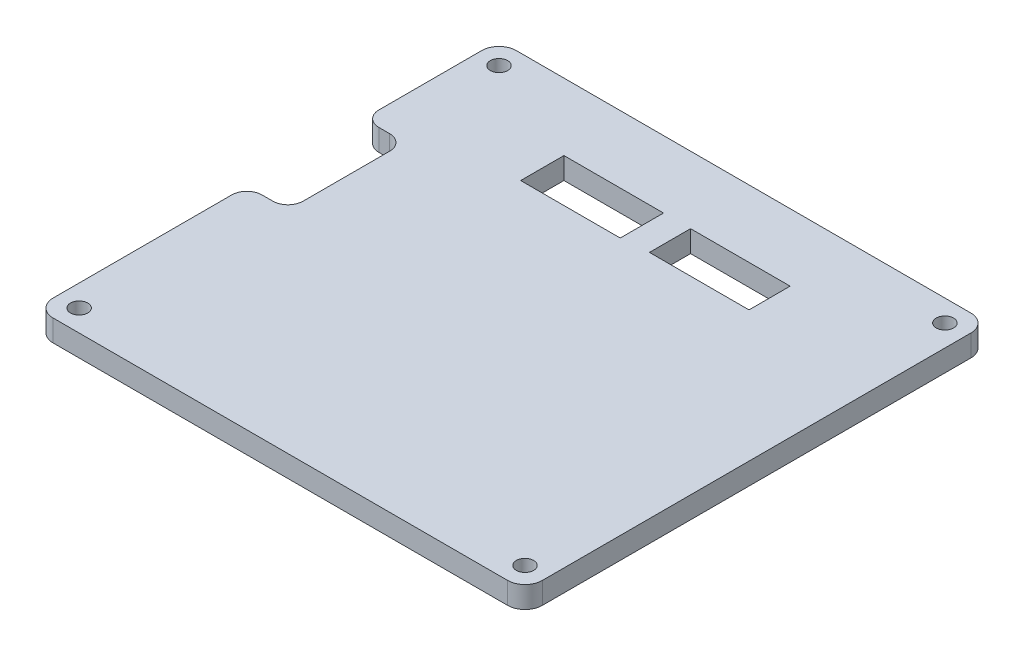
ISO-10303-21;
HEADER;
FILE_DESCRIPTION(('STEP AP214'),'2;1');
FILE_NAME('part.step','',(''),(''),'','','');
FILE_SCHEMA(('AUTOMOTIVE_DESIGN { 1 0 10303 214 1 1 1 1 }'));
ENDSEC;
DATA;
#1=APPLICATION_CONTEXT('core data for automotive mechanical design processes');
#2=APPLICATION_PROTOCOL_DEFINITION('international standard','automotive_design',2000,#1);
#3=PRODUCT_CONTEXT('',#1,'mechanical');
#4=PRODUCT('Part','Part','',(#3));
#5=PRODUCT_RELATED_PRODUCT_CATEGORY('part','',(#4));
#6=PRODUCT_DEFINITION_FORMATION('','',#4);
#7=PRODUCT_DEFINITION_CONTEXT('part definition',#1,'design');
#8=PRODUCT_DEFINITION('design','',#6,#7);
#9=PRODUCT_DEFINITION_SHAPE('','',#8);
#10=(LENGTH_UNIT() NAMED_UNIT(*) SI_UNIT(.MILLI.,.METRE.));
#11=(NAMED_UNIT(*) PLANE_ANGLE_UNIT() SI_UNIT($,.RADIAN.));
#12=(NAMED_UNIT(*) SI_UNIT($,.STERADIAN.) SOLID_ANGLE_UNIT());
#13=UNCERTAINTY_MEASURE_WITH_UNIT(LENGTH_MEASURE(1.E-05),#10,'distance_accuracy_value','');
#14=(GEOMETRIC_REPRESENTATION_CONTEXT(3) GLOBAL_UNCERTAINTY_ASSIGNED_CONTEXT((#13)) GLOBAL_UNIT_ASSIGNED_CONTEXT((#10,
#11,#12)) REPRESENTATION_CONTEXT('',''));
#15=CARTESIAN_POINT('',(0.,0.,0.));
#16=DIRECTION('',(0.,0.,1.));
#17=DIRECTION('',(1.,0.,0.));
#18=AXIS2_PLACEMENT_3D('',#15,#16,#17);
#19=CARTESIAN_POINT('',(-56.5,5.,53.5));
#20=DIRECTION('',(1.,0.,0.));
#21=DIRECTION('',(0.,0.,-1.));
#22=AXIS2_PLACEMENT_3D('',#19,#20,#21);
#23=PLANE('',#22);
#24=DIRECTION('',(0.,0.,1.));
#25=VECTOR('',#24,1.);
#26=CARTESIAN_POINT('',(-56.5,5.,53.5));
#27=LINE('',#26,#25);
#28=CARTESIAN_POINT('',(-56.5,5.,8.25));
#29=VERTEX_POINT('',#28);
#30=CARTESIAN_POINT('',(-56.5,5.,49.5));
#31=VERTEX_POINT('',#30);
#32=EDGE_CURVE('E317',#29,#31,#27,.T.);
#33=ORIENTED_EDGE('',*,*,#32,.F.);
#34=DIRECTION('',(0.,-1.,0.));
#35=VECTOR('',#34,1.);
#36=CARTESIAN_POINT('',(-56.5,5.,8.25));
#37=LINE('',#36,#35);
#38=CARTESIAN_POINT('',(-56.5,0.,8.25));
#39=VERTEX_POINT('',#38);
#40=EDGE_CURVE('E395',#29,#39,#37,.T.);
#41=ORIENTED_EDGE('',*,*,#40,.T.);
#42=DIRECTION('',(0.,0.,1.));
#43=VECTOR('',#42,1.);
#44=CARTESIAN_POINT('',(-56.5,0.,53.5));
#45=LINE('',#44,#43);
#46=CARTESIAN_POINT('',(-56.5,0.,49.5));
#47=VERTEX_POINT('',#46);
#48=EDGE_CURVE('E329',#39,#47,#45,.T.);
#49=ORIENTED_EDGE('',*,*,#48,.T.);
#50=DIRECTION('',(0.,-1.,0.));
#51=VECTOR('',#50,1.);
#52=CARTESIAN_POINT('',(-56.5,5.,49.5));
#53=LINE('',#52,#51);
#54=EDGE_CURVE('E368',#47,#31,#53,.F.);
#55=ORIENTED_EDGE('',*,*,#54,.T.);
#56=EDGE_LOOP('',(#33,#41,#49,#55));
#57=FACE_BOUND('',#56,.T.);
#58=ADVANCED_FACE('F33',(#57),#23,.F.);
#59=CARTESIAN_POINT('',(0.,0.,0.));
#60=DIRECTION('',(0.,-1.,0.));
#61=DIRECTION('',(0.,0.,-1.));
#62=AXIS2_PLACEMENT_3D('',#59,#60,#61);
#63=PLANE('',#62);
#64=ORIENTED_EDGE('',*,*,#48,.F.);
#65=CARTESIAN_POINT('',(-53.,0.,8.25));
#66=DIRECTION('',(0.,-1.,0.));
#67=DIRECTION('',(0.,0.,-1.));
#68=AXIS2_PLACEMENT_3D('',#65,#66,#67);
#69=CIRCLE('',#68,3.5);
#70=CARTESIAN_POINT('',(-53.,0.,4.75));
#71=VERTEX_POINT('',#70);
#72=EDGE_CURVE('E399',#39,#71,#69,.T.);
#73=ORIENTED_EDGE('',*,*,#72,.T.);
#74=DIRECTION('',(-1.,0.,0.));
#75=VECTOR('',#74,1.);
#76=CARTESIAN_POINT('',(-47.,0.,4.75));
#77=LINE('',#76,#75);
#78=CARTESIAN_POINT('',(-50.5,0.,4.75));
#79=VERTEX_POINT('',#78);
#80=EDGE_CURVE('E443',#79,#71,#77,.T.);
#81=ORIENTED_EDGE('',*,*,#80,.F.);
#82=CARTESIAN_POINT('',(-50.5,0.,1.25));
#83=DIRECTION('',(0.,-1.,0.));
#84=DIRECTION('',(0.,0.,-1.));
#85=AXIS2_PLACEMENT_3D('',#82,#83,#84);
#86=CIRCLE('',#85,3.5);
#87=CARTESIAN_POINT('',(-47.,0.,1.25));
#88=VERTEX_POINT('',#87);
#89=EDGE_CURVE('E406',#79,#88,#86,.F.);
#90=ORIENTED_EDGE('',*,*,#89,.T.);
#91=DIRECTION('',(0.,0.,1.));
#92=VECTOR('',#91,1.);
#93=CARTESIAN_POINT('',(-47.,0.,4.75));
#94=LINE('',#93,#92);
#95=CARTESIAN_POINT('',(-47.,0.,-18.75));
#96=VERTEX_POINT('',#95);
#97=EDGE_CURVE('E416',#96,#88,#94,.T.);
#98=ORIENTED_EDGE('',*,*,#97,.F.);
#99=CARTESIAN_POINT('',(-50.5,0.,-18.75));
#100=DIRECTION('',(0.,-1.,0.));
#101=DIRECTION('',(0.,0.,-1.));
#102=AXIS2_PLACEMENT_3D('',#99,#100,#101);
#103=CIRCLE('',#102,3.5);
#104=CARTESIAN_POINT('',(-50.5,0.,-22.25));
#105=VERTEX_POINT('',#104);
#106=EDGE_CURVE('E41',#96,#105,#103,.F.);
#107=ORIENTED_EDGE('',*,*,#106,.T.);
#108=DIRECTION('',(1.,0.,0.));
#109=VECTOR('',#108,1.);
#110=CARTESIAN_POINT('',(-47.,0.,-22.25));
#111=LINE('',#110,#109);
#112=CARTESIAN_POINT('',(-53.,0.,-22.25));
#113=VERTEX_POINT('',#112);
#114=EDGE_CURVE('E414',#113,#105,#111,.T.);
#115=ORIENTED_EDGE('',*,*,#114,.F.);
#116=CARTESIAN_POINT('',(-53.,0.,-25.75));
#117=DIRECTION('',(0.,-1.,0.));
#118=DIRECTION('',(0.,0.,-1.));
#119=AXIS2_PLACEMENT_3D('',#116,#117,#118);
#120=CIRCLE('',#119,3.5);
#121=CARTESIAN_POINT('',(-56.5,0.,-25.75));
#122=VERTEX_POINT('',#121);
#123=EDGE_CURVE('E56',#113,#122,#120,.T.);
#124=ORIENTED_EDGE('',*,*,#123,.T.);
#125=CARTESIAN_POINT('',(-56.5,0.,-49.5));
#126=VERTEX_POINT('',#125);
#127=EDGE_CURVE('E330',#126,#122,#45,.T.);
#128=ORIENTED_EDGE('',*,*,#127,.F.);
#129=CARTESIAN_POINT('',(-52.5,0.,-49.5));
#130=DIRECTION('',(0.,-1.,0.));
#131=DIRECTION('',(0.,0.,-1.));
#132=AXIS2_PLACEMENT_3D('',#129,#130,#131);
#133=CIRCLE('',#132,4.);
#134=CARTESIAN_POINT('',(-52.5,0.,-53.5));
#135=VERTEX_POINT('',#134);
#136=EDGE_CURVE('E338',#126,#135,#133,.T.);
#137=ORIENTED_EDGE('',*,*,#136,.T.);
#138=DIRECTION('',(-1.,0.,0.));
#139=VECTOR('',#138,1.);
#140=CARTESIAN_POINT('',(-56.5,0.,-53.5));
#141=LINE('',#140,#139);
#142=CARTESIAN_POINT('',(52.5,0.,-53.5));
#143=VERTEX_POINT('',#142);
#144=EDGE_CURVE('E326',#143,#135,#141,.T.);
#145=ORIENTED_EDGE('',*,*,#144,.F.);
#146=CARTESIAN_POINT('',(52.5,0.,-49.5));
#147=DIRECTION('',(0.,-1.,0.));
#148=DIRECTION('',(0.,0.,-1.));
#149=AXIS2_PLACEMENT_3D('',#146,#147,#148);
#150=CIRCLE('',#149,4.);
#151=CARTESIAN_POINT('',(56.5,0.,-49.5));
#152=VERTEX_POINT('',#151);
#153=EDGE_CURVE('E345',#143,#152,#150,.T.);
#154=ORIENTED_EDGE('',*,*,#153,.T.);
#155=DIRECTION('',(0.,0.,-1.));
#156=VECTOR('',#155,1.);
#157=CARTESIAN_POINT('',(56.5,0.,53.5));
#158=LINE('',#157,#156);
#159=CARTESIAN_POINT('',(56.5,0.,49.5));
#160=VERTEX_POINT('',#159);
#161=EDGE_CURVE('E309',#160,#152,#158,.T.);
#162=ORIENTED_EDGE('',*,*,#161,.F.);
#163=CARTESIAN_POINT('',(52.5,0.,49.5));
#164=DIRECTION('',(0.,-1.,0.));
#165=DIRECTION('',(0.,0.,-1.));
#166=AXIS2_PLACEMENT_3D('',#163,#164,#165);
#167=CIRCLE('',#166,4.);
#168=CARTESIAN_POINT('',(52.5,0.,53.5));
#169=VERTEX_POINT('',#168);
#170=EDGE_CURVE('E343',#160,#169,#167,.T.);
#171=ORIENTED_EDGE('',*,*,#170,.T.);
#172=DIRECTION('',(1.,0.,0.));
#173=VECTOR('',#172,1.);
#174=CARTESIAN_POINT('',(-56.5,0.,53.5));
#175=LINE('',#174,#173);
#176=CARTESIAN_POINT('',(20.,0.,53.5));
#177=VERTEX_POINT('',#176);
#178=EDGE_CURVE('E332',#177,#169,#175,.T.);
#179=ORIENTED_EDGE('',*,*,#178,.F.);
#180=DIRECTION('',(0.,0.,-1.));
#181=VECTOR('',#180,1.);
#182=CARTESIAN_POINT('',(20.,0.,53.5));
#183=LINE('',#182,#181);
#184=CARTESIAN_POINT('',(20.,0.,33.5));
#185=VERTEX_POINT('',#184);
#186=EDGE_CURVE('E285',#177,#185,#183,.T.);
#187=ORIENTED_EDGE('',*,*,#186,.T.);
#188=DIRECTION('',(1.,0.,0.));
#189=VECTOR('',#188,1.);
#190=CARTESIAN_POINT('',(-20.,0.,33.5));
#191=LINE('',#190,#189);
#192=CARTESIAN_POINT('',(-20.,0.,33.5));
#193=VERTEX_POINT('',#192);
#194=EDGE_CURVE('E306',#193,#185,#191,.T.);
#195=ORIENTED_EDGE('',*,*,#194,.F.);
#196=DIRECTION('',(0.,0.,-1.));
#197=VECTOR('',#196,1.);
#198=CARTESIAN_POINT('',(-20.,0.,53.5));
#199=LINE('',#198,#197);
#200=CARTESIAN_POINT('',(-20.,0.,53.5));
#201=VERTEX_POINT('',#200);
#202=EDGE_CURVE('E286',#201,#193,#199,.T.);
#203=ORIENTED_EDGE('',*,*,#202,.F.);
#204=CARTESIAN_POINT('',(-52.5,0.,53.5));
#205=VERTEX_POINT('',#204);
#206=EDGE_CURVE('E314',#205,#201,#175,.T.);
#207=ORIENTED_EDGE('',*,*,#206,.F.);
#208=CARTESIAN_POINT('',(-52.5,0.,49.5));
#209=DIRECTION('',(0.,-1.,0.));
#210=DIRECTION('',(0.,0.,-1.));
#211=AXIS2_PLACEMENT_3D('',#208,#209,#210);
#212=CIRCLE('',#211,4.);
#213=EDGE_CURVE('E340',#205,#47,#212,.T.);
#214=ORIENTED_EDGE('',*,*,#213,.T.);
#215=EDGE_LOOP('',(#64,#73,#81,#90,#98,#107,#115,#124,#128,#137,#145,#154,#162,#171,#179,#187,
#195,#203,#207,#214));
#216=FACE_BOUND('',#215,.T.);
#217=CARTESIAN_POINT('',(51.5,0.,-48.5));
#218=DIRECTION('',(0.,-1.,0.));
#219=DIRECTION('',(0.,0.,-1.));
#220=AXIS2_PLACEMENT_3D('',#217,#218,#219);
#221=CIRCLE('',#220,2.);
#222=CARTESIAN_POINT('',(51.5,0.,-50.5));
#223=VERTEX_POINT('',#222);
#224=EDGE_CURVE('E252',#223,#223,#221,.T.);
#225=ORIENTED_EDGE('',*,*,#224,.F.);
#226=EDGE_LOOP('',(#225));
#227=FACE_BOUND('',#226,.T.);
#228=CARTESIAN_POINT('',(51.5,0.,48.5));
#229=DIRECTION('',(0.,-1.,0.));
#230=DIRECTION('',(0.,0.,-1.));
#231=AXIS2_PLACEMENT_3D('',#228,#229,#230);
#232=CIRCLE('',#231,2.);
#233=CARTESIAN_POINT('',(51.5,0.,46.5));
#234=VERTEX_POINT('',#233);
#235=EDGE_CURVE('E810',#234,#234,#232,.T.);
#236=ORIENTED_EDGE('',*,*,#235,.F.);
#237=EDGE_LOOP('',(#236));
#238=FACE_BOUND('',#237,.T.);
#239=CARTESIAN_POINT('',(-51.5,0.,48.5));
#240=DIRECTION('',(0.,-1.,0.));
#241=DIRECTION('',(0.,0.,-1.));
#242=AXIS2_PLACEMENT_3D('',#239,#240,#241);
#243=CIRCLE('',#242,2.);
#244=CARTESIAN_POINT('',(-51.5,0.,46.5));
#245=VERTEX_POINT('',#244);
#246=EDGE_CURVE('E813',#245,#245,#243,.T.);
#247=ORIENTED_EDGE('',*,*,#246,.F.);
#248=EDGE_LOOP('',(#247));
#249=FACE_BOUND('',#248,.T.);
#250=CARTESIAN_POINT('',(-51.5,0.,-48.5));
#251=DIRECTION('',(0.,-1.,0.));
#252=DIRECTION('',(0.,0.,-1.));
#253=AXIS2_PLACEMENT_3D('',#250,#251,#252);
#254=CIRCLE('',#253,2.);
#255=CARTESIAN_POINT('',(-51.5,0.,-50.5));
#256=VERTEX_POINT('',#255);
#257=EDGE_CURVE('E816',#256,#256,#254,.T.);
#258=ORIENTED_EDGE('',*,*,#257,.F.);
#259=EDGE_LOOP('',(#258));
#260=FACE_BOUND('',#259,.T.);
#261=DIRECTION('',(0.,0.,1.));
#262=VECTOR('',#261,1.);
#263=CARTESIAN_POINT('',(-2.99999999999999,0.,0.));
#264=LINE('',#263,#262);
#265=CARTESIAN_POINT('',(-2.99999999999999,0.,-38.));
#266=VERTEX_POINT('',#265);
#267=CARTESIAN_POINT('',(-2.99999999999999,0.,-28.));
#268=VERTEX_POINT('',#267);
#269=EDGE_CURVE('E283',#266,#268,#264,.T.);
#270=ORIENTED_EDGE('',*,*,#269,.F.);
#271=DIRECTION('',(1.,0.,0.));
#272=VECTOR('',#271,1.);
#273=CARTESIAN_POINT('',(0.,0.,-38.));
#274=LINE('',#273,#272);
#275=CARTESIAN_POINT('',(-26.,0.,-38.));
#276=VERTEX_POINT('',#275);
#277=EDGE_CURVE('E278',#276,#266,#274,.T.);
#278=ORIENTED_EDGE('',*,*,#277,.F.);
#279=DIRECTION('',(0.,0.,-1.));
#280=VECTOR('',#279,1.);
#281=CARTESIAN_POINT('',(-26.,0.,0.));
#282=LINE('',#281,#280);
#283=CARTESIAN_POINT('',(-26.,0.,-28.));
#284=VERTEX_POINT('',#283);
#285=EDGE_CURVE('E221',#284,#276,#282,.T.);
#286=ORIENTED_EDGE('',*,*,#285,.F.);
#287=DIRECTION('',(-1.,0.,0.));
#288=VECTOR('',#287,1.);
#289=CARTESIAN_POINT('',(0.,0.,-28.));
#290=LINE('',#289,#288);
#291=EDGE_CURVE('E281',#268,#284,#290,.T.);
#292=ORIENTED_EDGE('',*,*,#291,.F.);
#293=EDGE_LOOP('',(#270,#278,#286,#292));
#294=FACE_BOUND('',#293,.T.);
#295=DIRECTION('',(0.,0.,1.));
#296=VECTOR('',#295,1.);
#297=CARTESIAN_POINT('',(26.25,0.,0.));
#298=LINE('',#297,#296);
#299=CARTESIAN_POINT('',(26.25,0.,-38.));
#300=VERTEX_POINT('',#299);
#301=CARTESIAN_POINT('',(26.25,0.,-28.5));
#302=VERTEX_POINT('',#301);
#303=EDGE_CURVE('E276',#300,#302,#298,.T.);
#304=ORIENTED_EDGE('',*,*,#303,.F.);
#305=DIRECTION('',(1.,0.,0.));
#306=VECTOR('',#305,1.);
#307=CARTESIAN_POINT('',(0.,0.,-38.));
#308=LINE('',#307,#306);
#309=CARTESIAN_POINT('',(3.25000000000001,0.,-38.));
#310=VERTEX_POINT('',#309);
#311=EDGE_CURVE('E246',#310,#300,#308,.T.);
#312=ORIENTED_EDGE('',*,*,#311,.F.);
#313=DIRECTION('',(0.,0.,-1.));
#314=VECTOR('',#313,1.);
#315=CARTESIAN_POINT('',(3.25000000000001,0.,0.));
#316=LINE('',#315,#314);
#317=CARTESIAN_POINT('',(3.25000000000001,0.,-28.5));
#318=VERTEX_POINT('',#317);
#319=EDGE_CURVE('E271',#318,#310,#316,.T.);
#320=ORIENTED_EDGE('',*,*,#319,.F.);
#321=DIRECTION('',(-1.,0.,0.));
#322=VECTOR('',#321,1.);
#323=CARTESIAN_POINT('',(0.,0.,-28.5));
#324=LINE('',#323,#322);
#325=EDGE_CURVE('E274',#302,#318,#324,.T.);
#326=ORIENTED_EDGE('',*,*,#325,.F.);
#327=EDGE_LOOP('',(#304,#312,#320,#326));
#328=FACE_BOUND('',#327,.T.);
#329=ADVANCED_FACE('F412',(#216,#227,#238,#249,#260,#294,#328),#63,.T.);
#330=CARTESIAN_POINT('',(56.5,5.,53.5));
#331=DIRECTION('',(-1.,0.,0.));
#332=DIRECTION('',(0.,0.,1.));
#333=AXIS2_PLACEMENT_3D('',#330,#331,#332);
#334=PLANE('',#333);
#335=ORIENTED_EDGE('',*,*,#161,.T.);
#336=DIRECTION('',(0.,-1.,0.));
#337=VECTOR('',#336,1.);
#338=CARTESIAN_POINT('',(56.5,5.,-49.5));
#339=LINE('',#338,#337);
#340=CARTESIAN_POINT('',(56.5,5.,-49.5));
#341=VERTEX_POINT('',#340);
#342=EDGE_CURVE('E350',#152,#341,#339,.F.);
#343=ORIENTED_EDGE('',*,*,#342,.T.);
#344=DIRECTION('',(0.,0.,-1.));
#345=VECTOR('',#344,1.);
#346=CARTESIAN_POINT('',(56.5,5.,53.5));
#347=LINE('',#346,#345);
#348=CARTESIAN_POINT('',(56.5,5.,49.5));
#349=VERTEX_POINT('',#348);
#350=EDGE_CURVE('E310',#349,#341,#347,.T.);
#351=ORIENTED_EDGE('',*,*,#350,.F.);
#352=DIRECTION('',(0.,-1.,0.));
#353=VECTOR('',#352,1.);
#354=CARTESIAN_POINT('',(56.5,5.,49.5));
#355=LINE('',#354,#353);
#356=EDGE_CURVE('E347',#349,#160,#355,.T.);
#357=ORIENTED_EDGE('',*,*,#356,.T.);
#358=EDGE_LOOP('',(#335,#343,#351,#357));
#359=FACE_BOUND('',#358,.T.);
#360=ADVANCED_FACE('F467',(#359),#334,.F.);
#361=CARTESIAN_POINT('',(-56.5,5.,-53.5));
#362=DIRECTION('',(0.,0.,1.));
#363=DIRECTION('',(1.,0.,0.));
#364=AXIS2_PLACEMENT_3D('',#361,#362,#363);
#365=PLANE('',#364);
#366=DIRECTION('',(-1.,0.,0.));
#367=VECTOR('',#366,1.);
#368=CARTESIAN_POINT('',(-56.5,5.,-53.5));
#369=LINE('',#368,#367);
#370=CARTESIAN_POINT('',(52.5,5.,-53.5));
#371=VERTEX_POINT('',#370);
#372=CARTESIAN_POINT('',(-52.5,5.,-53.5));
#373=VERTEX_POINT('',#372);
#374=EDGE_CURVE('E313',#371,#373,#369,.T.);
#375=ORIENTED_EDGE('',*,*,#374,.F.);
#376=DIRECTION('',(0.,-1.,0.));
#377=VECTOR('',#376,1.);
#378=CARTESIAN_POINT('',(52.5,5.,-53.5));
#379=LINE('',#378,#377);
#380=EDGE_CURVE('E335',#371,#143,#379,.T.);
#381=ORIENTED_EDGE('',*,*,#380,.T.);
#382=ORIENTED_EDGE('',*,*,#144,.T.);
#383=DIRECTION('',(0.,-1.,0.));
#384=VECTOR('',#383,1.);
#385=CARTESIAN_POINT('',(-52.5,5.,-53.5));
#386=LINE('',#385,#384);
#387=EDGE_CURVE('E323',#135,#373,#386,.F.);
#388=ORIENTED_EDGE('',*,*,#387,.T.);
#389=EDGE_LOOP('',(#375,#381,#382,#388));
#390=FACE_BOUND('',#389,.T.);
#391=ADVANCED_FACE('F476',(#390),#365,.F.);
#392=ORIENTED_EDGE('',*,*,#127,.T.);
#393=DIRECTION('',(0.,-1.,0.));
#394=VECTOR('',#393,1.);
#395=CARTESIAN_POINT('',(-56.5,5.,-25.75));
#396=LINE('',#395,#394);
#397=CARTESIAN_POINT('',(-56.5,5.,-25.75));
#398=VERTEX_POINT('',#397);
#399=EDGE_CURVE('E48',#122,#398,#396,.F.);
#400=ORIENTED_EDGE('',*,*,#399,.T.);
#401=CARTESIAN_POINT('',(-56.5,5.,-49.5));
#402=VERTEX_POINT('',#401);
#403=EDGE_CURVE('E318',#402,#398,#27,.T.);
#404=ORIENTED_EDGE('',*,*,#403,.F.);
#405=DIRECTION('',(0.,-1.,0.));
#406=VECTOR('',#405,1.);
#407=CARTESIAN_POINT('',(-56.5,5.,-49.5));
#408=LINE('',#407,#406);
#409=EDGE_CURVE('E365',#402,#126,#408,.T.);
#410=ORIENTED_EDGE('',*,*,#409,.T.);
#411=EDGE_LOOP('',(#392,#400,#404,#410));
#412=FACE_BOUND('',#411,.T.);
#413=ADVANCED_FACE('F483',(#412),#23,.F.);
#414=CARTESIAN_POINT('',(-56.5,5.,53.5));
#415=DIRECTION('',(0.,0.,-1.));
#416=DIRECTION('',(-1.,0.,0.));
#417=AXIS2_PLACEMENT_3D('',#414,#415,#416);
#418=PLANE('',#417);
#419=ORIENTED_EDGE('',*,*,#178,.T.);
#420=DIRECTION('',(0.,-1.,0.));
#421=VECTOR('',#420,1.);
#422=CARTESIAN_POINT('',(52.5,5.,53.5));
#423=LINE('',#422,#421);
#424=CARTESIAN_POINT('',(52.5,5.,53.5));
#425=VERTEX_POINT('',#424);
#426=EDGE_CURVE('E363',#169,#425,#423,.F.);
#427=ORIENTED_EDGE('',*,*,#426,.T.);
#428=DIRECTION('',(1.,0.,0.));
#429=VECTOR('',#428,1.);
#430=CARTESIAN_POINT('',(-56.5,5.,53.5));
#431=LINE('',#430,#429);
#432=CARTESIAN_POINT('',(-52.5,5.,53.5));
#433=VERTEX_POINT('',#432);
#434=EDGE_CURVE('E320',#433,#425,#431,.T.);
#435=ORIENTED_EDGE('',*,*,#434,.F.);
#436=DIRECTION('',(0.,-1.,0.));
#437=VECTOR('',#436,1.);
#438=CARTESIAN_POINT('',(-52.5,5.,53.5));
#439=LINE('',#438,#437);
#440=EDGE_CURVE('E360',#433,#205,#439,.T.);
#441=ORIENTED_EDGE('',*,*,#440,.T.);
#442=ORIENTED_EDGE('',*,*,#206,.T.);
#443=DIRECTION('',(1.,0.,0.));
#444=VECTOR('',#443,1.);
#445=CARTESIAN_POINT('',(-20.,0.,53.5));
#446=LINE('',#445,#444);
#447=EDGE_CURVE('E295',#201,#177,#446,.T.);
#448=ORIENTED_EDGE('',*,*,#447,.T.);
#449=EDGE_LOOP('',(#419,#427,#435,#441,#442,#448));
#450=FACE_BOUND('',#449,.T.);
#451=ADVANCED_FACE('F458',(#450),#418,.F.);
#452=CARTESIAN_POINT('',(0.,5.,0.));
#453=DIRECTION('',(0.,-1.,0.));
#454=DIRECTION('',(0.,0.,-1.));
#455=AXIS2_PLACEMENT_3D('',#452,#453,#454);
#456=PLANE('',#455);
#457=CARTESIAN_POINT('',(51.5,5.,-48.5));
#458=DIRECTION('',(0.,1.,0.));
#459=DIRECTION('',(0.,0.,1.));
#460=AXIS2_PLACEMENT_3D('',#457,#458,#459);
#461=CIRCLE('',#460,2.);
#462=CARTESIAN_POINT('',(51.5,5.,-46.5));
#463=VERTEX_POINT('',#462);
#464=EDGE_CURVE('E823',#463,#463,#461,.T.);
#465=ORIENTED_EDGE('',*,*,#464,.F.);
#466=EDGE_LOOP('',(#465));
#467=FACE_BOUND('',#466,.T.);
#468=CARTESIAN_POINT('',(51.5,5.,48.5));
#469=DIRECTION('',(0.,1.,0.));
#470=DIRECTION('',(0.,0.,1.));
#471=AXIS2_PLACEMENT_3D('',#468,#469,#470);
#472=CIRCLE('',#471,2.);
#473=CARTESIAN_POINT('',(51.5,5.,50.5));
#474=VERTEX_POINT('',#473);
#475=EDGE_CURVE('E826',#474,#474,#472,.T.);
#476=ORIENTED_EDGE('',*,*,#475,.F.);
#477=EDGE_LOOP('',(#476));
#478=FACE_BOUND('',#477,.T.);
#479=CARTESIAN_POINT('',(-51.5,5.,48.5));
#480=DIRECTION('',(0.,1.,0.));
#481=DIRECTION('',(0.,0.,1.));
#482=AXIS2_PLACEMENT_3D('',#479,#480,#481);
#483=CIRCLE('',#482,2.);
#484=CARTESIAN_POINT('',(-51.5,5.,50.5));
#485=VERTEX_POINT('',#484);
#486=EDGE_CURVE('E822',#485,#485,#483,.T.);
#487=ORIENTED_EDGE('',*,*,#486,.F.);
#488=EDGE_LOOP('',(#487));
#489=FACE_BOUND('',#488,.T.);
#490=CARTESIAN_POINT('',(-51.5,5.,-48.5));
#491=DIRECTION('',(0.,1.,0.));
#492=DIRECTION('',(0.,0.,1.));
#493=AXIS2_PLACEMENT_3D('',#490,#491,#492);
#494=CIRCLE('',#493,2.);
#495=CARTESIAN_POINT('',(-51.5,5.,-46.5));
#496=VERTEX_POINT('',#495);
#497=EDGE_CURVE('E819',#496,#496,#494,.T.);
#498=ORIENTED_EDGE('',*,*,#497,.F.);
#499=EDGE_LOOP('',(#498));
#500=FACE_BOUND('',#499,.T.);
#501=DIRECTION('',(-1.,0.,0.));
#502=VECTOR('',#501,1.);
#503=CARTESIAN_POINT('',(-26.,5.,-38.));
#504=LINE('',#503,#502);
#505=CARTESIAN_POINT('',(-2.99999999999999,5.,-38.));
#506=VERTEX_POINT('',#505);
#507=CARTESIAN_POINT('',(-26.,5.,-38.));
#508=VERTEX_POINT('',#507);
#509=EDGE_CURVE('E229',#506,#508,#504,.T.);
#510=ORIENTED_EDGE('',*,*,#509,.F.);
#511=DIRECTION('',(0.,0.,-1.));
#512=VECTOR('',#511,1.);
#513=CARTESIAN_POINT('',(-2.99999999999999,5.,-28.));
#514=LINE('',#513,#512);
#515=CARTESIAN_POINT('',(-2.99999999999999,5.,-28.));
#516=VERTEX_POINT('',#515);
#517=EDGE_CURVE('E234',#516,#506,#514,.T.);
#518=ORIENTED_EDGE('',*,*,#517,.F.);
#519=DIRECTION('',(1.,0.,0.));
#520=VECTOR('',#519,1.);
#521=CARTESIAN_POINT('',(-26.,5.,-28.));
#522=LINE('',#521,#520);
#523=CARTESIAN_POINT('',(-26.,5.,-28.));
#524=VERTEX_POINT('',#523);
#525=EDGE_CURVE('E239',#524,#516,#522,.T.);
#526=ORIENTED_EDGE('',*,*,#525,.F.);
#527=DIRECTION('',(0.,0.,1.));
#528=VECTOR('',#527,1.);
#529=CARTESIAN_POINT('',(-26.,5.,-28.));
#530=LINE('',#529,#528);
#531=EDGE_CURVE('E218',#508,#524,#530,.T.);
#532=ORIENTED_EDGE('',*,*,#531,.F.);
#533=EDGE_LOOP('',(#510,#518,#526,#532));
#534=FACE_BOUND('',#533,.T.);
#535=DIRECTION('',(-1.,0.,0.));
#536=VECTOR('',#535,1.);
#537=CARTESIAN_POINT('',(3.25000000000001,5.,-38.));
#538=LINE('',#537,#536);
#539=CARTESIAN_POINT('',(26.25,5.,-38.));
#540=VERTEX_POINT('',#539);
#541=CARTESIAN_POINT('',(3.25000000000001,5.,-38.));
#542=VERTEX_POINT('',#541);
#543=EDGE_CURVE('E251',#540,#542,#538,.T.);
#544=ORIENTED_EDGE('',*,*,#543,.F.);
#545=DIRECTION('',(0.,0.,-1.));
#546=VECTOR('',#545,1.);
#547=CARTESIAN_POINT('',(26.25,5.,-28.5));
#548=LINE('',#547,#546);
#549=CARTESIAN_POINT('',(26.25,5.,-28.5));
#550=VERTEX_POINT('',#549);
#551=EDGE_CURVE('E249',#550,#540,#548,.T.);
#552=ORIENTED_EDGE('',*,*,#551,.F.);
#553=DIRECTION('',(1.,0.,0.));
#554=VECTOR('',#553,1.);
#555=CARTESIAN_POINT('',(3.25000000000001,5.,-28.5));
#556=LINE('',#555,#554);
#557=CARTESIAN_POINT('',(3.25000000000001,5.,-28.5));
#558=VERTEX_POINT('',#557);
#559=EDGE_CURVE('E258',#558,#550,#556,.T.);
#560=ORIENTED_EDGE('',*,*,#559,.F.);
#561=DIRECTION('',(0.,0.,1.));
#562=VECTOR('',#561,1.);
#563=CARTESIAN_POINT('',(3.25000000000001,5.,-28.5));
#564=LINE('',#563,#562);
#565=EDGE_CURVE('E255',#542,#558,#564,.T.);
#566=ORIENTED_EDGE('',*,*,#565,.F.);
#567=EDGE_LOOP('',(#544,#552,#560,#566));
#568=FACE_BOUND('',#567,.T.);
#569=DIRECTION('',(-1.,0.,0.));
#570=VECTOR('',#569,1.);
#571=CARTESIAN_POINT('',(0.,5.,4.75000000000001));
#572=LINE('',#571,#570);
#573=CARTESIAN_POINT('',(-50.5,5.,4.75));
#574=VERTEX_POINT('',#573);
#575=CARTESIAN_POINT('',(-53.,5.,4.75));
#576=VERTEX_POINT('',#575);
#577=EDGE_CURVE('E377',#574,#576,#572,.T.);
#578=ORIENTED_EDGE('',*,*,#577,.T.);
#579=CARTESIAN_POINT('',(-53.,5.,8.25));
#580=DIRECTION('',(0.,-1.,0.));
#581=DIRECTION('',(0.,0.,-1.));
#582=AXIS2_PLACEMENT_3D('',#579,#580,#581);
#583=CIRCLE('',#582,3.5);
#584=EDGE_CURVE('E403',#576,#29,#583,.F.);
#585=ORIENTED_EDGE('',*,*,#584,.T.);
#586=ORIENTED_EDGE('',*,*,#32,.T.);
#587=CARTESIAN_POINT('',(-52.5,5.,49.5));
#588=DIRECTION('',(0.,-1.,0.));
#589=DIRECTION('',(0.,0.,-1.));
#590=AXIS2_PLACEMENT_3D('',#587,#588,#589);
#591=CIRCLE('',#590,4.);
#592=EDGE_CURVE('E354',#31,#433,#591,.F.);
#593=ORIENTED_EDGE('',*,*,#592,.T.);
#594=ORIENTED_EDGE('',*,*,#434,.T.);
#595=CARTESIAN_POINT('',(52.5,5.,49.5));
#596=DIRECTION('',(0.,-1.,0.));
#597=DIRECTION('',(0.,0.,-1.));
#598=AXIS2_PLACEMENT_3D('',#595,#596,#597);
#599=CIRCLE('',#598,4.);
#600=EDGE_CURVE('E356',#425,#349,#599,.F.);
#601=ORIENTED_EDGE('',*,*,#600,.T.);
#602=ORIENTED_EDGE('',*,*,#350,.T.);
#603=CARTESIAN_POINT('',(52.5,5.,-49.5));
#604=DIRECTION('',(0.,-1.,0.));
#605=DIRECTION('',(0.,0.,-1.));
#606=AXIS2_PLACEMENT_3D('',#603,#604,#605);
#607=CIRCLE('',#606,4.);
#608=EDGE_CURVE('E358',#341,#371,#607,.F.);
#609=ORIENTED_EDGE('',*,*,#608,.T.);
#610=ORIENTED_EDGE('',*,*,#374,.T.);
#611=CARTESIAN_POINT('',(-52.5,5.,-49.5));
#612=DIRECTION('',(0.,-1.,0.));
#613=DIRECTION('',(0.,0.,-1.));
#614=AXIS2_PLACEMENT_3D('',#611,#612,#613);
#615=CIRCLE('',#614,4.);
#616=EDGE_CURVE('E352',#373,#402,#615,.F.);
#617=ORIENTED_EDGE('',*,*,#616,.T.);
#618=ORIENTED_EDGE('',*,*,#403,.T.);
#619=CARTESIAN_POINT('',(-53.,5.,-25.75));
#620=DIRECTION('',(0.,-1.,0.));
#621=DIRECTION('',(0.,0.,-1.));
#622=AXIS2_PLACEMENT_3D('',#619,#620,#621);
#623=CIRCLE('',#622,3.5);
#624=CARTESIAN_POINT('',(-53.,5.,-22.25));
#625=VERTEX_POINT('',#624);
#626=EDGE_CURVE('E401',#398,#625,#623,.F.);
#627=ORIENTED_EDGE('',*,*,#626,.T.);
#628=DIRECTION('',(1.,0.,0.));
#629=VECTOR('',#628,1.);
#630=CARTESIAN_POINT('',(0.,5.,-22.25));
#631=LINE('',#630,#629);
#632=CARTESIAN_POINT('',(-50.5,5.,-22.25));
#633=VERTEX_POINT('',#632);
#634=EDGE_CURVE('E371',#625,#633,#631,.T.);
#635=ORIENTED_EDGE('',*,*,#634,.T.);
#636=CARTESIAN_POINT('',(-50.5,5.,-18.75));
#637=DIRECTION('',(0.,-1.,0.));
#638=DIRECTION('',(0.,0.,-1.));
#639=AXIS2_PLACEMENT_3D('',#636,#637,#638);
#640=CIRCLE('',#639,3.5);
#641=CARTESIAN_POINT('',(-47.,5.,-18.75));
#642=VERTEX_POINT('',#641);
#643=EDGE_CURVE('E11',#633,#642,#640,.T.);
#644=ORIENTED_EDGE('',*,*,#643,.T.);
#645=DIRECTION('',(0.,0.,1.));
#646=VECTOR('',#645,1.);
#647=CARTESIAN_POINT('',(-47.,5.,0.));
#648=LINE('',#647,#646);
#649=CARTESIAN_POINT('',(-47.,5.,1.25));
#650=VERTEX_POINT('',#649);
#651=EDGE_CURVE('E374',#642,#650,#648,.T.);
#652=ORIENTED_EDGE('',*,*,#651,.T.);
#653=CARTESIAN_POINT('',(-50.5,5.,1.25));
#654=DIRECTION('',(0.,-1.,0.));
#655=DIRECTION('',(0.,0.,-1.));
#656=AXIS2_PLACEMENT_3D('',#653,#654,#655);
#657=CIRCLE('',#656,3.5);
#658=EDGE_CURVE('E408',#650,#574,#657,.T.);
#659=ORIENTED_EDGE('',*,*,#658,.T.);
#660=EDGE_LOOP('',(#578,#585,#586,#593,#594,#601,#602,#609,#610,#617,#618,#627,#635,#644,#652,#659));
#661=FACE_BOUND('',#660,.T.);
#662=ADVANCED_FACE('F236',(#467,#478,#489,#500,#534,#568,#661),#456,.F.);
#663=CARTESIAN_POINT('',(-20.,0.,33.5));
#664=DIRECTION('',(0.,0.,1.));
#665=DIRECTION('',(1.,0.,0.));
#666=AXIS2_PLACEMENT_3D('',#663,#664,#665);
#667=PLANE('',#666);
#668=DIRECTION('',(0.,-1.,0.));
#669=VECTOR('',#668,1.);
#670=CARTESIAN_POINT('',(20.,0.,33.5));
#671=LINE('',#670,#669);
#672=CARTESIAN_POINT('',(20.,-4.59530888039167,33.5));
#673=VERTEX_POINT('',#672);
#674=EDGE_CURVE('E297',#185,#673,#671,.T.);
#675=ORIENTED_EDGE('',*,*,#674,.T.);
#676=DIRECTION('',(1.,0.,0.));
#677=VECTOR('',#676,1.);
#678=CARTESIAN_POINT('',(-20.,-4.59530888039167,33.5));
#679=LINE('',#678,#677);
#680=CARTESIAN_POINT('',(-20.,-4.59530888039167,33.5));
#681=VERTEX_POINT('',#680);
#682=EDGE_CURVE('E303',#681,#673,#679,.T.);
#683=ORIENTED_EDGE('',*,*,#682,.F.);
#684=DIRECTION('',(0.,-1.,0.));
#685=VECTOR('',#684,1.);
#686=CARTESIAN_POINT('',(-20.,0.,33.5));
#687=LINE('',#686,#685);
#688=EDGE_CURVE('E289',#193,#681,#687,.T.);
#689=ORIENTED_EDGE('',*,*,#688,.F.);
#690=ORIENTED_EDGE('',*,*,#194,.T.);
#691=EDGE_LOOP('',(#675,#683,#689,#690));
#692=FACE_BOUND('',#691,.T.);
#693=ADVANCED_FACE('F497',(#692),#667,.F.);
#694=CARTESIAN_POINT('',(-20.,-4.59530888039167,33.5));
#695=DIRECTION('',(0.,0.974605098677307,-0.223930573241342));
#696=DIRECTION('',(0.,0.223930573241342,0.974605098677308));
#697=AXIS2_PLACEMENT_3D('',#694,#695,#696);
#698=PLANE('',#697);
#699=DIRECTION('',(0.,0.223930573241342,0.974605098677307));
#700=VECTOR('',#699,1.);
#701=CARTESIAN_POINT('',(20.,-4.59530888039167,33.5));
#702=LINE('',#701,#700);
#703=EDGE_CURVE('E290',#673,#177,#702,.T.);
#704=ORIENTED_EDGE('',*,*,#703,.T.);
#705=ORIENTED_EDGE('',*,*,#447,.F.);
#706=DIRECTION('',(0.,0.223930573241342,0.974605098677307));
#707=VECTOR('',#706,1.);
#708=CARTESIAN_POINT('',(-20.,-4.59530888039167,33.5));
#709=LINE('',#708,#707);
#710=EDGE_CURVE('E292',#681,#201,#709,.T.);
#711=ORIENTED_EDGE('',*,*,#710,.F.);
#712=ORIENTED_EDGE('',*,*,#682,.T.);
#713=EDGE_LOOP('',(#704,#705,#711,#712));
#714=FACE_BOUND('',#713,.T.);
#715=ADVANCED_FACE('F491',(#714),#698,.F.);
#716=CARTESIAN_POINT('',(-20.,0.,0.));
#717=DIRECTION('',(-1.,0.,0.));
#718=DIRECTION('',(0.,0.,1.));
#719=AXIS2_PLACEMENT_3D('',#716,#717,#718);
#720=PLANE('',#719);
#721=ORIENTED_EDGE('',*,*,#202,.T.);
#722=ORIENTED_EDGE('',*,*,#688,.T.);
#723=ORIENTED_EDGE('',*,*,#710,.T.);
#724=EDGE_LOOP('',(#721,#722,#723));
#725=FACE_BOUND('',#724,.T.);
#726=ADVANCED_FACE('F499',(#725),#720,.T.);
#727=CARTESIAN_POINT('',(20.,0.,0.));
#728=DIRECTION('',(-1.,0.,0.));
#729=DIRECTION('',(0.,0.,1.));
#730=AXIS2_PLACEMENT_3D('',#727,#728,#729);
#731=PLANE('',#730);
#732=ORIENTED_EDGE('',*,*,#186,.F.);
#733=ORIENTED_EDGE('',*,*,#703,.F.);
#734=ORIENTED_EDGE('',*,*,#674,.F.);
#735=EDGE_LOOP('',(#732,#733,#734));
#736=FACE_BOUND('',#735,.T.);
#737=ADVANCED_FACE('F494',(#736),#731,.F.);
#738=CARTESIAN_POINT('',(26.25,-35.,-28.5));
#739=DIRECTION('',(1.,0.,0.));
#740=DIRECTION('',(0.,0.,-1.));
#741=AXIS2_PLACEMENT_3D('',#738,#739,#740);
#742=PLANE('',#741);
#743=ORIENTED_EDGE('',*,*,#303,.T.);
#744=DIRECTION('',(0.,1.,0.));
#745=VECTOR('',#744,1.);
#746=CARTESIAN_POINT('',(26.25,-35.,-28.5));
#747=LINE('',#746,#745);
#748=EDGE_CURVE('E262',#302,#550,#747,.T.);
#749=ORIENTED_EDGE('',*,*,#748,.T.);
#750=ORIENTED_EDGE('',*,*,#551,.T.);
#751=DIRECTION('',(0.,1.,0.));
#752=VECTOR('',#751,1.);
#753=CARTESIAN_POINT('',(26.25,-35.,-38.));
#754=LINE('',#753,#752);
#755=EDGE_CURVE('E261',#300,#540,#754,.T.);
#756=ORIENTED_EDGE('',*,*,#755,.F.);
#757=EDGE_LOOP('',(#743,#749,#750,#756));
#758=FACE_BOUND('',#757,.T.);
#759=ADVANCED_FACE('F506',(#758),#742,.F.);
#760=CARTESIAN_POINT('',(3.25000000000001,-35.,-28.5));
#761=DIRECTION('',(0.,0.,1.));
#762=DIRECTION('',(1.,0.,0.));
#763=AXIS2_PLACEMENT_3D('',#760,#761,#762);
#764=PLANE('',#763);
#765=ORIENTED_EDGE('',*,*,#325,.T.);
#766=DIRECTION('',(0.,1.,0.));
#767=VECTOR('',#766,1.);
#768=CARTESIAN_POINT('',(3.25000000000001,-35.,-28.5));
#769=LINE('',#768,#767);
#770=EDGE_CURVE('E264',#318,#558,#769,.T.);
#771=ORIENTED_EDGE('',*,*,#770,.T.);
#772=ORIENTED_EDGE('',*,*,#559,.T.);
#773=ORIENTED_EDGE('',*,*,#748,.F.);
#774=EDGE_LOOP('',(#765,#771,#772,#773));
#775=FACE_BOUND('',#774,.T.);
#776=ADVANCED_FACE('F747',(#775),#764,.F.);
#777=CARTESIAN_POINT('',(3.25000000000001,-35.,-28.5));
#778=DIRECTION('',(-1.,0.,0.));
#779=DIRECTION('',(0.,0.,1.));
#780=AXIS2_PLACEMENT_3D('',#777,#778,#779);
#781=PLANE('',#780);
#782=ORIENTED_EDGE('',*,*,#319,.T.);
#783=DIRECTION('',(0.,1.,0.));
#784=VECTOR('',#783,1.);
#785=CARTESIAN_POINT('',(3.25000000000001,-35.,-38.));
#786=LINE('',#785,#784);
#787=EDGE_CURVE('E266',#310,#542,#786,.T.);
#788=ORIENTED_EDGE('',*,*,#787,.T.);
#789=ORIENTED_EDGE('',*,*,#565,.T.);
#790=ORIENTED_EDGE('',*,*,#770,.F.);
#791=EDGE_LOOP('',(#782,#788,#789,#790));
#792=FACE_BOUND('',#791,.T.);
#793=ADVANCED_FACE('F737',(#792),#781,.F.);
#794=CARTESIAN_POINT('',(3.25000000000001,-35.,-38.));
#795=DIRECTION('',(0.,0.,-1.));
#796=DIRECTION('',(-1.,0.,0.));
#797=AXIS2_PLACEMENT_3D('',#794,#795,#796);
#798=PLANE('',#797);
#799=ORIENTED_EDGE('',*,*,#311,.T.);
#800=ORIENTED_EDGE('',*,*,#755,.T.);
#801=ORIENTED_EDGE('',*,*,#543,.T.);
#802=ORIENTED_EDGE('',*,*,#787,.F.);
#803=EDGE_LOOP('',(#799,#800,#801,#802));
#804=FACE_BOUND('',#803,.T.);
#805=ADVANCED_FACE('F727',(#804),#798,.F.);
#806=CARTESIAN_POINT('',(-2.99999999999999,-35.,-28.));
#807=DIRECTION('',(1.,0.,0.));
#808=DIRECTION('',(0.,0.,-1.));
#809=AXIS2_PLACEMENT_3D('',#806,#807,#808);
#810=PLANE('',#809);
#811=ORIENTED_EDGE('',*,*,#269,.T.);
#812=DIRECTION('',(0.,1.,0.));
#813=VECTOR('',#812,1.);
#814=CARTESIAN_POINT('',(-2.99999999999999,-35.,-28.));
#815=LINE('',#814,#813);
#816=EDGE_CURVE('E244',#268,#516,#815,.T.);
#817=ORIENTED_EDGE('',*,*,#816,.T.);
#818=ORIENTED_EDGE('',*,*,#517,.T.);
#819=DIRECTION('',(0.,1.,0.));
#820=VECTOR('',#819,1.);
#821=CARTESIAN_POINT('',(-2.99999999999999,-35.,-38.));
#822=LINE('',#821,#820);
#823=EDGE_CURVE('E225',#266,#506,#822,.T.);
#824=ORIENTED_EDGE('',*,*,#823,.F.);
#825=EDGE_LOOP('',(#811,#817,#818,#824));
#826=FACE_BOUND('',#825,.T.);
#827=ADVANCED_FACE('F717',(#826),#810,.F.);
#828=CARTESIAN_POINT('',(-26.,-35.,-28.));
#829=DIRECTION('',(0.,0.,1.));
#830=DIRECTION('',(1.,0.,0.));
#831=AXIS2_PLACEMENT_3D('',#828,#829,#830);
#832=PLANE('',#831);
#833=ORIENTED_EDGE('',*,*,#291,.T.);
#834=DIRECTION('',(0.,1.,0.));
#835=VECTOR('',#834,1.);
#836=CARTESIAN_POINT('',(-26.,-35.,-28.));
#837=LINE('',#836,#835);
#838=EDGE_CURVE('E224',#284,#524,#837,.T.);
#839=ORIENTED_EDGE('',*,*,#838,.T.);
#840=ORIENTED_EDGE('',*,*,#525,.T.);
#841=ORIENTED_EDGE('',*,*,#816,.F.);
#842=EDGE_LOOP('',(#833,#839,#840,#841));
#843=FACE_BOUND('',#842,.T.);
#844=ADVANCED_FACE('F708',(#843),#832,.F.);
#845=CARTESIAN_POINT('',(-26.,-35.,-28.));
#846=DIRECTION('',(-1.,0.,0.));
#847=DIRECTION('',(0.,0.,1.));
#848=AXIS2_PLACEMENT_3D('',#845,#846,#847);
#849=PLANE('',#848);
#850=ORIENTED_EDGE('',*,*,#285,.T.);
#851=DIRECTION('',(0.,1.,0.));
#852=VECTOR('',#851,1.);
#853=CARTESIAN_POINT('',(-26.,-35.,-38.));
#854=LINE('',#853,#852);
#855=EDGE_CURVE('E213',#276,#508,#854,.T.);
#856=ORIENTED_EDGE('',*,*,#855,.T.);
#857=ORIENTED_EDGE('',*,*,#531,.T.);
#858=ORIENTED_EDGE('',*,*,#838,.F.);
#859=EDGE_LOOP('',(#850,#856,#857,#858));
#860=FACE_BOUND('',#859,.T.);
#861=ADVANCED_FACE('F215',(#860),#849,.F.);
#862=CARTESIAN_POINT('',(-26.,-35.,-38.));
#863=DIRECTION('',(0.,0.,-1.));
#864=DIRECTION('',(-1.,0.,0.));
#865=AXIS2_PLACEMENT_3D('',#862,#863,#864);
#866=PLANE('',#865);
#867=ORIENTED_EDGE('',*,*,#277,.T.);
#868=ORIENTED_EDGE('',*,*,#823,.T.);
#869=ORIENTED_EDGE('',*,*,#509,.T.);
#870=ORIENTED_EDGE('',*,*,#855,.F.);
#871=EDGE_LOOP('',(#867,#868,#869,#870));
#872=FACE_BOUND('',#871,.T.);
#873=ADVANCED_FACE('F230',(#872),#866,.F.);
#874=CARTESIAN_POINT('',(-51.5,-4.59530888039167,-48.5));
#875=DIRECTION('',(0.,1.,0.));
#876=DIRECTION('',(0.,0.,1.));
#877=AXIS2_PLACEMENT_3D('',#874,#875,#876);
#878=CYLINDRICAL_SURFACE('',#877,2.);
#879=ORIENTED_EDGE('',*,*,#257,.T.);
#880=EDGE_LOOP('',(#879));
#881=FACE_BOUND('',#880,.T.);
#882=ORIENTED_EDGE('',*,*,#497,.T.);
#883=EDGE_LOOP('',(#882));
#884=FACE_BOUND('',#883,.T.);
#885=ADVANCED_FACE('F681',(#881,#884),#878,.F.);
#886=CARTESIAN_POINT('',(-51.5,-4.59530888039167,48.5));
#887=DIRECTION('',(0.,1.,0.));
#888=DIRECTION('',(0.,0.,1.));
#889=AXIS2_PLACEMENT_3D('',#886,#887,#888);
#890=CYLINDRICAL_SURFACE('',#889,2.);
#891=ORIENTED_EDGE('',*,*,#246,.T.);
#892=EDGE_LOOP('',(#891));
#893=FACE_BOUND('',#892,.T.);
#894=ORIENTED_EDGE('',*,*,#486,.T.);
#895=EDGE_LOOP('',(#894));
#896=FACE_BOUND('',#895,.T.);
#897=ADVANCED_FACE('F671',(#893,#896),#890,.F.);
#898=CARTESIAN_POINT('',(51.5,-4.59530888039167,48.5));
#899=DIRECTION('',(0.,1.,0.));
#900=DIRECTION('',(0.,0.,1.));
#901=AXIS2_PLACEMENT_3D('',#898,#899,#900);
#902=CYLINDRICAL_SURFACE('',#901,2.);
#903=ORIENTED_EDGE('',*,*,#235,.T.);
#904=EDGE_LOOP('',(#903));
#905=FACE_BOUND('',#904,.T.);
#906=ORIENTED_EDGE('',*,*,#475,.T.);
#907=EDGE_LOOP('',(#906));
#908=FACE_BOUND('',#907,.T.);
#909=ADVANCED_FACE('F661',(#905,#908),#902,.F.);
#910=CARTESIAN_POINT('',(51.5,-4.59530888039167,-48.5));
#911=DIRECTION('',(0.,1.,0.));
#912=DIRECTION('',(0.,0.,1.));
#913=AXIS2_PLACEMENT_3D('',#910,#911,#912);
#914=CYLINDRICAL_SURFACE('',#913,2.);
#915=ORIENTED_EDGE('',*,*,#224,.T.);
#916=EDGE_LOOP('',(#915));
#917=FACE_BOUND('',#916,.T.);
#918=ORIENTED_EDGE('',*,*,#464,.T.);
#919=EDGE_LOOP('',(#918));
#920=FACE_BOUND('',#919,.T.);
#921=ADVANCED_FACE('F530',(#917,#920),#914,.F.);
#922=CARTESIAN_POINT('',(52.5,5.,-49.5));
#923=DIRECTION('',(0.,-1.,0.));
#924=DIRECTION('',(0.,0.,-1.));
#925=AXIS2_PLACEMENT_3D('',#922,#923,#924);
#926=CYLINDRICAL_SURFACE('',#925,4.);
#927=ORIENTED_EDGE('',*,*,#608,.F.);
#928=ORIENTED_EDGE('',*,*,#342,.F.);
#929=ORIENTED_EDGE('',*,*,#153,.F.);
#930=ORIENTED_EDGE('',*,*,#380,.F.);
#931=EDGE_LOOP('',(#927,#928,#929,#930));
#932=FACE_BOUND('',#931,.T.);
#933=ADVANCED_FACE('F471',(#932),#926,.T.);
#934=CARTESIAN_POINT('',(52.5,5.,49.5));
#935=DIRECTION('',(0.,-1.,0.));
#936=DIRECTION('',(0.,0.,-1.));
#937=AXIS2_PLACEMENT_3D('',#934,#935,#936);
#938=CYLINDRICAL_SURFACE('',#937,4.);
#939=ORIENTED_EDGE('',*,*,#600,.F.);
#940=ORIENTED_EDGE('',*,*,#426,.F.);
#941=ORIENTED_EDGE('',*,*,#170,.F.);
#942=ORIENTED_EDGE('',*,*,#356,.F.);
#943=EDGE_LOOP('',(#939,#940,#941,#942));
#944=FACE_BOUND('',#943,.T.);
#945=ADVANCED_FACE('F462',(#944),#938,.T.);
#946=CARTESIAN_POINT('',(-52.5,5.,49.5));
#947=DIRECTION('',(0.,-1.,0.));
#948=DIRECTION('',(0.,0.,-1.));
#949=AXIS2_PLACEMENT_3D('',#946,#947,#948);
#950=CYLINDRICAL_SURFACE('',#949,4.);
#951=ORIENTED_EDGE('',*,*,#592,.F.);
#952=ORIENTED_EDGE('',*,*,#54,.F.);
#953=ORIENTED_EDGE('',*,*,#213,.F.);
#954=ORIENTED_EDGE('',*,*,#440,.F.);
#955=EDGE_LOOP('',(#951,#952,#953,#954));
#956=FACE_BOUND('',#955,.T.);
#957=ADVANCED_FACE('F453',(#956),#950,.T.);
#958=CARTESIAN_POINT('',(-52.5,5.,-49.5));
#959=DIRECTION('',(0.,-1.,0.));
#960=DIRECTION('',(0.,0.,-1.));
#961=AXIS2_PLACEMENT_3D('',#958,#959,#960);
#962=CYLINDRICAL_SURFACE('',#961,4.);
#963=ORIENTED_EDGE('',*,*,#616,.F.);
#964=ORIENTED_EDGE('',*,*,#387,.F.);
#965=ORIENTED_EDGE('',*,*,#136,.F.);
#966=ORIENTED_EDGE('',*,*,#409,.F.);
#967=EDGE_LOOP('',(#963,#964,#965,#966));
#968=FACE_BOUND('',#967,.T.);
#969=ADVANCED_FACE('F480',(#968),#962,.T.);
#970=CARTESIAN_POINT('',(-47.,10.,4.75));
#971=DIRECTION('',(0.,0.,1.));
#972=DIRECTION('',(1.,0.,0.));
#973=AXIS2_PLACEMENT_3D('',#970,#971,#972);
#974=PLANE('',#973);
#975=ORIENTED_EDGE('',*,*,#577,.F.);
#976=DIRECTION('',(0.,-1.,0.));
#977=VECTOR('',#976,1.);
#978=CARTESIAN_POINT('',(-50.5,0.,4.75));
#979=LINE('',#978,#977);
#980=EDGE_CURVE('E382',#574,#79,#979,.T.);
#981=ORIENTED_EDGE('',*,*,#980,.T.);
#982=ORIENTED_EDGE('',*,*,#80,.T.);
#983=DIRECTION('',(0.,-1.,0.));
#984=VECTOR('',#983,1.);
#985=CARTESIAN_POINT('',(-53.,10.,4.75));
#986=LINE('',#985,#984);
#987=EDGE_CURVE('E380',#71,#576,#986,.F.);
#988=ORIENTED_EDGE('',*,*,#987,.T.);
#989=EDGE_LOOP('',(#975,#981,#982,#988));
#990=FACE_BOUND('',#989,.T.);
#991=ADVANCED_FACE('F439',(#990),#974,.F.);
#992=CARTESIAN_POINT('',(-47.,10.,4.75));
#993=DIRECTION('',(1.,0.,0.));
#994=DIRECTION('',(0.,0.,-1.));
#995=AXIS2_PLACEMENT_3D('',#992,#993,#994);
#996=PLANE('',#995);
#997=ORIENTED_EDGE('',*,*,#97,.T.);
#998=DIRECTION('',(0.,-1.,0.));
#999=VECTOR('',#998,1.);
#1000=CARTESIAN_POINT('',(-47.,5.,1.25));
#1001=LINE('',#1000,#999);
#1002=EDGE_CURVE('E388',#88,#650,#1001,.F.);
#1003=ORIENTED_EDGE('',*,*,#1002,.T.);
#1004=ORIENTED_EDGE('',*,*,#651,.F.);
#1005=DIRECTION('',(0.,-1.,0.));
#1006=VECTOR('',#1005,1.);
#1007=CARTESIAN_POINT('',(-47.,0.,-18.75));
#1008=LINE('',#1007,#1006);
#1009=EDGE_CURVE('E385',#642,#96,#1008,.T.);
#1010=ORIENTED_EDGE('',*,*,#1009,.T.);
#1011=EDGE_LOOP('',(#997,#1003,#1004,#1010));
#1012=FACE_BOUND('',#1011,.T.);
#1013=ADVANCED_FACE('F431',(#1012),#996,.F.);
#1014=CARTESIAN_POINT('',(-47.,10.,-22.25));
#1015=DIRECTION('',(0.,0.,-1.));
#1016=DIRECTION('',(-1.,0.,0.));
#1017=AXIS2_PLACEMENT_3D('',#1014,#1015,#1016);
#1018=PLANE('',#1017);
#1019=ORIENTED_EDGE('',*,*,#114,.T.);
#1020=DIRECTION('',(0.,-1.,0.));
#1021=VECTOR('',#1020,1.);
#1022=CARTESIAN_POINT('',(-50.5,5.,-22.25));
#1023=LINE('',#1022,#1021);
#1024=EDGE_CURVE('E393',#105,#633,#1023,.F.);
#1025=ORIENTED_EDGE('',*,*,#1024,.T.);
#1026=ORIENTED_EDGE('',*,*,#634,.F.);
#1027=DIRECTION('',(0.,-1.,0.));
#1028=VECTOR('',#1027,1.);
#1029=CARTESIAN_POINT('',(-53.,10.,-22.25));
#1030=LINE('',#1029,#1028);
#1031=EDGE_CURVE('E390',#625,#113,#1030,.T.);
#1032=ORIENTED_EDGE('',*,*,#1031,.T.);
#1033=EDGE_LOOP('',(#1019,#1025,#1026,#1032));
#1034=FACE_BOUND('',#1033,.T.);
#1035=ADVANCED_FACE('F421',(#1034),#1018,.F.);
#1036=CARTESIAN_POINT('',(-50.5,10.,1.25));
#1037=DIRECTION('',(0.,1.,0.));
#1038=DIRECTION('',(0.,0.,1.));
#1039=AXIS2_PLACEMENT_3D('',#1036,#1037,#1038);
#1040=CYLINDRICAL_SURFACE('',#1039,3.5);
#1041=ORIENTED_EDGE('',*,*,#658,.F.);
#1042=ORIENTED_EDGE('',*,*,#1002,.F.);
#1043=ORIENTED_EDGE('',*,*,#89,.F.);
#1044=ORIENTED_EDGE('',*,*,#980,.F.);
#1045=EDGE_LOOP('',(#1041,#1042,#1043,#1044));
#1046=FACE_BOUND('',#1045,.T.);
#1047=ADVANCED_FACE('F434',(#1046),#1040,.F.);
#1048=CARTESIAN_POINT('',(-50.5,10.,-18.75));
#1049=DIRECTION('',(0.,1.,0.));
#1050=DIRECTION('',(0.,0.,1.));
#1051=AXIS2_PLACEMENT_3D('',#1048,#1049,#1050);
#1052=CYLINDRICAL_SURFACE('',#1051,3.5);
#1053=ORIENTED_EDGE('',*,*,#643,.F.);
#1054=ORIENTED_EDGE('',*,*,#1024,.F.);
#1055=ORIENTED_EDGE('',*,*,#106,.F.);
#1056=ORIENTED_EDGE('',*,*,#1009,.F.);
#1057=EDGE_LOOP('',(#1053,#1054,#1055,#1056));
#1058=FACE_BOUND('',#1057,.T.);
#1059=ADVANCED_FACE('F426',(#1058),#1052,.F.);
#1060=CARTESIAN_POINT('',(-53.,5.,8.25));
#1061=DIRECTION('',(0.,-1.,0.));
#1062=DIRECTION('',(0.,0.,-1.));
#1063=AXIS2_PLACEMENT_3D('',#1060,#1061,#1062);
#1064=CYLINDRICAL_SURFACE('',#1063,3.5);
#1065=ORIENTED_EDGE('',*,*,#584,.F.);
#1066=ORIENTED_EDGE('',*,*,#987,.F.);
#1067=ORIENTED_EDGE('',*,*,#72,.F.);
#1068=ORIENTED_EDGE('',*,*,#40,.F.);
#1069=EDGE_LOOP('',(#1065,#1066,#1067,#1068));
#1070=FACE_BOUND('',#1069,.T.);
#1071=ADVANCED_FACE('F445',(#1070),#1064,.T.);
#1072=CARTESIAN_POINT('',(-53.,10.,-25.75));
#1073=DIRECTION('',(0.,-1.,0.));
#1074=DIRECTION('',(0.,0.,-1.));
#1075=AXIS2_PLACEMENT_3D('',#1072,#1073,#1074);
#1076=CYLINDRICAL_SURFACE('',#1075,3.5);
#1077=ORIENTED_EDGE('',*,*,#626,.F.);
#1078=ORIENTED_EDGE('',*,*,#399,.F.);
#1079=ORIENTED_EDGE('',*,*,#123,.F.);
#1080=ORIENTED_EDGE('',*,*,#1031,.F.);
#1081=EDGE_LOOP('',(#1077,#1078,#1079,#1080));
#1082=FACE_BOUND('',#1081,.T.);
#1083=ADVANCED_FACE('F35',(#1082),#1076,.T.);
#1084=CLOSED_SHELL('',(#58,#329,#360,#391,#413,#451,#662,#693,#715,#726,#737,#759,#776,#793,
#805,#827,#844,#861,#873,#885,#897,#909,#921,#933,#945,#957,#969,#991,#1013,#1035,#1047,#1059,
#1071,#1083));
#1085=MANIFOLD_SOLID_BREP('B2',#1084);
#1086=ADVANCED_BREP_SHAPE_REPRESENTATION('',(#18,#1085),#14);
#1087=SHAPE_DEFINITION_REPRESENTATION(#9,#1086);
ENDSEC;
END-ISO-10303-21;
